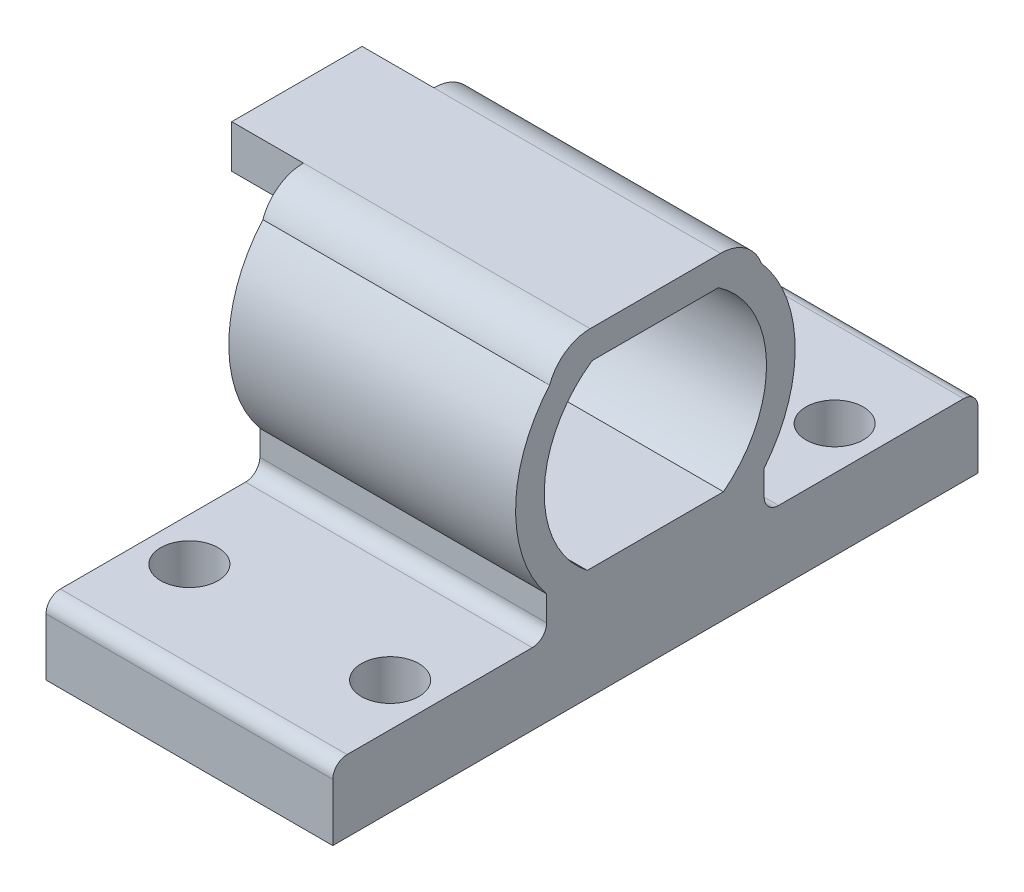
ISO-10303-21;
HEADER;
FILE_DESCRIPTION(('STEP AP214'),'2;1');
FILE_NAME('part.step','',(''),(''),'','','');
FILE_SCHEMA(('AUTOMOTIVE_DESIGN { 1 0 10303 214 1 1 1 1 }'));
ENDSEC;
DATA;
#1=APPLICATION_CONTEXT('core data for automotive mechanical design processes');
#2=APPLICATION_PROTOCOL_DEFINITION('international standard','automotive_design',2000,#1);
#3=PRODUCT_CONTEXT('',#1,'mechanical');
#4=PRODUCT('Part','Part','',(#3));
#5=PRODUCT_RELATED_PRODUCT_CATEGORY('part','',(#4));
#6=PRODUCT_DEFINITION_FORMATION('','',#4);
#7=PRODUCT_DEFINITION_CONTEXT('part definition',#1,'design');
#8=PRODUCT_DEFINITION('design','',#6,#7);
#9=PRODUCT_DEFINITION_SHAPE('','',#8);
#10=(LENGTH_UNIT() NAMED_UNIT(*) SI_UNIT(.MILLI.,.METRE.));
#11=(NAMED_UNIT(*) PLANE_ANGLE_UNIT() SI_UNIT($,.RADIAN.));
#12=(NAMED_UNIT(*) SI_UNIT($,.STERADIAN.) SOLID_ANGLE_UNIT());
#13=UNCERTAINTY_MEASURE_WITH_UNIT(LENGTH_MEASURE(1.E-05),#10,'distance_accuracy_value','');
#14=(GEOMETRIC_REPRESENTATION_CONTEXT(3) GLOBAL_UNCERTAINTY_ASSIGNED_CONTEXT((#13)) GLOBAL_UNIT_ASSIGNED_CONTEXT((#10,
#11,#12)) REPRESENTATION_CONTEXT('',''));
#15=CARTESIAN_POINT('',(0.,0.,0.));
#16=DIRECTION('',(0.,0.,1.));
#17=DIRECTION('',(1.,0.,0.));
#18=AXIS2_PLACEMENT_3D('',#15,#16,#17);
#19=CARTESIAN_POINT('',(-5.07534246575342,3.80650684931507,25.));
#20=DIRECTION('',(1.,0.,0.));
#21=DIRECTION('',(0.,0.,-1.));
#22=AXIS2_PLACEMENT_3D('',#19,#20,#21);
#23=PLANE('',#22);
#24=DIRECTION('',(0.,1.,0.));
#25=VECTOR('',#24,1.);
#26=CARTESIAN_POINT('',(-5.07534246575342,15.3065068493151,17.0475886645501));
#27=LINE('',#26,#25);
#28=CARTESIAN_POINT('',(-5.07534246575342,16.2057341612604,17.0475886645501));
#29=VERTEX_POINT('',#28);
#30=CARTESIAN_POINT('',(-5.07534246575342,18.3065068493151,17.0475886645501));
#31=VERTEX_POINT('',#30);
#32=EDGE_CURVE('E11',#29,#31,#27,.T.);
#33=ORIENTED_EDGE('',*,*,#32,.F.);
#34=CARTESIAN_POINT('',(-5.07534246575343,9.93023120627303,12.5));
#35=DIRECTION('',(1.,0.,0.));
#36=DIRECTION('',(0.,0.,-1.));
#37=AXIS2_PLACEMENT_3D('',#34,#35,#36);
#38=CIRCLE('',#37,7.75);
#39=CARTESIAN_POINT('',(-5.07534246575342,3.80650684931507,17.25));
#40=VERTEX_POINT('',#39);
#41=EDGE_CURVE('E312',#29,#40,#38,.T.);
#42=ORIENTED_EDGE('',*,*,#41,.T.);
#43=DIRECTION('',(0.,0.,-1.));
#44=VECTOR('',#43,1.);
#45=CARTESIAN_POINT('',(-5.07534246575342,3.80650684931507,25.));
#46=LINE('',#45,#44);
#47=CARTESIAN_POINT('',(-5.07534246575343,3.80650684931508,7.75));
#48=VERTEX_POINT('',#47);
#49=EDGE_CURVE('E317',#40,#48,#46,.T.);
#50=ORIENTED_EDGE('',*,*,#49,.T.);
#51=CARTESIAN_POINT('',(-5.07534246575342,16.2057341612604,7.95241133544988));
#52=VERTEX_POINT('',#51);
#53=EDGE_CURVE('E314',#48,#52,#38,.T.);
#54=ORIENTED_EDGE('',*,*,#53,.T.);
#55=DIRECTION('',(0.,1.,0.));
#56=VECTOR('',#55,1.);
#57=CARTESIAN_POINT('',(-5.07534246575342,15.3065068493151,7.95241133544988));
#58=LINE('',#57,#56);
#59=CARTESIAN_POINT('',(-5.07534246575343,18.3065068493151,7.95241133544988));
#60=VERTEX_POINT('',#59);
#61=EDGE_CURVE('E42',#52,#60,#58,.T.);
#62=ORIENTED_EDGE('',*,*,#61,.T.);
#63=CARTESIAN_POINT('',(-5.07534246575343,15.3065068493151,7.95241133544988));
#64=DIRECTION('',(1.,0.,0.));
#65=DIRECTION('',(0.,0.,-1.));
#66=AXIS2_PLACEMENT_3D('',#63,#64,#65);
#67=CIRCLE('',#66,3.);
#68=CARTESIAN_POINT('',(-5.07534246575343,16.3065068493151,5.12398421070368));
#69=VERTEX_POINT('',#68);
#70=EDGE_CURVE('E354',#60,#69,#67,.F.);
#71=ORIENTED_EDGE('',*,*,#70,.T.);
#72=CARTESIAN_POINT('',(-5.07534246575343,9.93023120627303,12.5));
#73=DIRECTION('',(1.,0.,0.));
#74=DIRECTION('',(0.,0.,-1.));
#75=AXIS2_PLACEMENT_3D('',#72,#73,#74);
#76=CIRCLE('',#75,9.75);
#77=CARTESIAN_POINT('',(-5.07534246575342,3.80650684931507,4.91300454725326));
#78=VERTEX_POINT('',#77);
#79=EDGE_CURVE('E313',#69,#78,#76,.F.);
#80=ORIENTED_EDGE('',*,*,#79,.T.);
#81=DIRECTION('',(0.,-1.,0.));
#82=VECTOR('',#81,1.);
#83=CARTESIAN_POINT('',(-5.07534246575342,3.80650684931508,4.91300454725324));
#84=LINE('',#83,#82);
#85=CARTESIAN_POINT('',(-5.07534246575342,2.05650684931507,4.91300454725324));
#86=VERTEX_POINT('',#85);
#87=EDGE_CURVE('E291',#78,#86,#84,.T.);
#88=ORIENTED_EDGE('',*,*,#87,.T.);
#89=CARTESIAN_POINT('',(-5.07534246575342,2.05650684931507,3.91300454725324));
#90=DIRECTION('',(1.,0.,0.));
#91=DIRECTION('',(0.,0.,-1.));
#92=AXIS2_PLACEMENT_3D('',#89,#90,#91);
#93=CIRCLE('',#92,1.);
#94=CARTESIAN_POINT('',(-5.07534246575342,1.05650684931507,3.91300454725324));
#95=VERTEX_POINT('',#94);
#96=EDGE_CURVE('E37',#86,#95,#93,.T.);
#97=ORIENTED_EDGE('',*,*,#96,.T.);
#98=DIRECTION('',(0.,0.,-1.));
#99=VECTOR('',#98,1.);
#100=CARTESIAN_POINT('',(-5.07534246575342,1.05650684931507,4.91300454725324));
#101=LINE('',#100,#99);
#102=CARTESIAN_POINT('',(-5.07534246575342,1.05650684931507,-9.));
#103=VERTEX_POINT('',#102);
#104=EDGE_CURVE('E293',#95,#103,#101,.T.);
#105=ORIENTED_EDGE('',*,*,#104,.T.);
#106=CARTESIAN_POINT('',(-5.07534246575342,0.056506849315069,-9.));
#107=DIRECTION('',(1.,0.,0.));
#108=DIRECTION('',(0.,0.,-1.));
#109=AXIS2_PLACEMENT_3D('',#106,#107,#108);
#110=CIRCLE('',#109,1.);
#111=CARTESIAN_POINT('',(-5.07534246575342,0.056506849315069,-10.));
#112=VERTEX_POINT('',#111);
#113=EDGE_CURVE('E380',#103,#112,#110,.F.);
#114=ORIENTED_EDGE('',*,*,#113,.T.);
#115=DIRECTION('',(0.,1.,0.));
#116=VECTOR('',#115,1.);
#117=CARTESIAN_POINT('',(-5.07534246575342,1.05650684931507,-10.));
#118=LINE('',#117,#116);
#119=CARTESIAN_POINT('',(-5.07534246575342,-3.94349315068493,-10.));
#120=VERTEX_POINT('',#119);
#121=EDGE_CURVE('E274',#120,#112,#118,.T.);
#122=ORIENTED_EDGE('',*,*,#121,.F.);
#123=DIRECTION('',(0.,0.,-1.));
#124=VECTOR('',#123,1.);
#125=CARTESIAN_POINT('',(-5.07534246575342,-3.94349315068493,-10.));
#126=LINE('',#125,#124);
#127=CARTESIAN_POINT('',(-5.07534246575342,-3.94349315068493,35.));
#128=VERTEX_POINT('',#127);
#129=EDGE_CURVE('E219',#128,#120,#126,.T.);
#130=ORIENTED_EDGE('',*,*,#129,.F.);
#131=DIRECTION('',(0.,-1.,0.));
#132=VECTOR('',#131,1.);
#133=CARTESIAN_POINT('',(-5.07534246575342,1.05650684931507,35.));
#134=LINE('',#133,#132);
#135=CARTESIAN_POINT('',(-5.07534246575342,0.0565068493150677,35.));
#136=VERTEX_POINT('',#135);
#137=EDGE_CURVE('E210',#136,#128,#134,.T.);
#138=ORIENTED_EDGE('',*,*,#137,.F.);
#139=CARTESIAN_POINT('',(-5.07534246575342,0.0565068493150678,34.));
#140=DIRECTION('',(1.,0.,0.));
#141=DIRECTION('',(0.,0.,-1.));
#142=AXIS2_PLACEMENT_3D('',#139,#140,#141);
#143=CIRCLE('',#142,1.);
#144=CARTESIAN_POINT('',(-5.07534246575342,1.05650684931507,34.));
#145=VERTEX_POINT('',#144);
#146=EDGE_CURVE('E366',#136,#145,#143,.F.);
#147=ORIENTED_EDGE('',*,*,#146,.T.);
#148=DIRECTION('',(0.,0.,-1.));
#149=VECTOR('',#148,1.);
#150=CARTESIAN_POINT('',(-5.07534246575342,1.05650684931507,20.0869954527468));
#151=LINE('',#150,#149);
#152=CARTESIAN_POINT('',(-5.07534246575342,1.05650684931507,21.0869954527468));
#153=VERTEX_POINT('',#152);
#154=EDGE_CURVE('E301',#145,#153,#151,.T.);
#155=ORIENTED_EDGE('',*,*,#154,.T.);
#156=CARTESIAN_POINT('',(-5.07534246575342,2.05650684931507,21.0869954527468));
#157=DIRECTION('',(1.,0.,0.));
#158=DIRECTION('',(0.,0.,-1.));
#159=AXIS2_PLACEMENT_3D('',#156,#157,#158);
#160=CIRCLE('',#159,1.);
#161=CARTESIAN_POINT('',(-5.07534246575342,2.05650684931507,20.0869954527468));
#162=VERTEX_POINT('',#161);
#163=EDGE_CURVE('E389',#153,#162,#160,.T.);
#164=ORIENTED_EDGE('',*,*,#163,.T.);
#165=DIRECTION('',(0.,1.,0.));
#166=VECTOR('',#165,1.);
#167=CARTESIAN_POINT('',(-5.07534246575342,3.80650684931509,20.0869954527468));
#168=LINE('',#167,#166);
#169=CARTESIAN_POINT('',(-5.07534246575342,3.80650684931509,20.0869954527468));
#170=VERTEX_POINT('',#169);
#171=EDGE_CURVE('E299',#162,#170,#168,.T.);
#172=ORIENTED_EDGE('',*,*,#171,.T.);
#173=CARTESIAN_POINT('',(-5.07534246575342,16.3065068493151,19.8760157892963));
#174=VERTEX_POINT('',#173);
#175=EDGE_CURVE('E309',#170,#174,#76,.F.);
#176=ORIENTED_EDGE('',*,*,#175,.T.);
#177=CARTESIAN_POINT('',(-5.07534246575343,15.3065068493151,17.0475886645501));
#178=DIRECTION('',(1.,0.,0.));
#179=DIRECTION('',(0.,0.,-1.));
#180=AXIS2_PLACEMENT_3D('',#177,#178,#179);
#181=CIRCLE('',#180,3.);
#182=EDGE_CURVE('E361',#174,#31,#181,.F.);
#183=ORIENTED_EDGE('',*,*,#182,.T.);
#184=EDGE_LOOP('',(#33,#42,#50,#54,#62,#71,#80,#88,#97,#105,#114,#122,#130,#138,#147,#155,#164,
#172,#176,#183));
#185=FACE_BOUND('',#184,.T.);
#186=ADVANCED_FACE('F33',(#185),#23,.F.);
#187=CARTESIAN_POINT('',(-30.2194297421029,9.93023120627303,12.5));
#188=DIRECTION('',(1.,0.,0.));
#189=DIRECTION('',(0.,0.,-1.));
#190=AXIS2_PLACEMENT_3D('',#187,#188,#189);
#191=CYLINDRICAL_SURFACE('',#190,7.75);
#192=DIRECTION('',(1.,0.,0.));
#193=VECTOR('',#192,1.);
#194=CARTESIAN_POINT('',(-30.2194297421029,16.3065068493151,8.09482021661447));
#195=LINE('',#194,#193);
#196=CARTESIAN_POINT('',(-5.07534246575342,16.3065068493151,8.09482021661447));
#197=VERTEX_POINT('',#196);
#198=CARTESIAN_POINT('',(14.9246575342466,16.3065068493151,8.09482021661447));
#199=VERTEX_POINT('',#198);
#200=EDGE_CURVE('E288',#197,#199,#195,.T.);
#201=ORIENTED_EDGE('',*,*,#200,.F.);
#202=EDGE_CURVE('E318',#52,#197,#38,.T.);
#203=ORIENTED_EDGE('',*,*,#202,.F.);
#204=ORIENTED_EDGE('',*,*,#53,.F.);
#205=DIRECTION('',(1.,0.,0.));
#206=VECTOR('',#205,1.);
#207=CARTESIAN_POINT('',(-30.2194297421029,3.80650684931508,7.75));
#208=LINE('',#207,#206);
#209=CARTESIAN_POINT('',(14.9246575342466,3.80650684931508,7.75));
#210=VERTEX_POINT('',#209);
#211=EDGE_CURVE('E327',#48,#210,#208,.T.);
#212=ORIENTED_EDGE('',*,*,#211,.T.);
#213=CARTESIAN_POINT('',(14.9246575342466,9.93023120627303,12.5));
#214=DIRECTION('',(-1.,0.,0.));
#215=DIRECTION('',(0.,0.,-1.));
#216=AXIS2_PLACEMENT_3D('',#213,#214,#215);
#217=CIRCLE('',#216,7.75);
#218=EDGE_CURVE('E305',#199,#210,#217,.T.);
#219=ORIENTED_EDGE('',*,*,#218,.F.);
#220=EDGE_LOOP('',(#201,#203,#204,#212,#219));
#221=FACE_BOUND('',#220,.T.);
#222=ADVANCED_FACE('F441',(#221),#191,.F.);
#223=CARTESIAN_POINT('',(-30.2194297421029,9.93023120627303,12.5));
#224=DIRECTION('',(1.,0.,0.));
#225=DIRECTION('',(0.,0.,-1.));
#226=AXIS2_PLACEMENT_3D('',#223,#224,#225);
#227=CYLINDRICAL_SURFACE('',#226,9.75);
#228=DIRECTION('',(1.,0.,0.));
#229=VECTOR('',#228,1.);
#230=CARTESIAN_POINT('',(-30.2194297421029,16.3065068493151,5.12398421070368));
#231=LINE('',#230,#229);
#232=CARTESIAN_POINT('',(14.9246575342466,16.3065068493151,5.12398421070368));
#233=VERTEX_POINT('',#232);
#234=EDGE_CURVE('E346',#233,#69,#231,.F.);
#235=ORIENTED_EDGE('',*,*,#234,.F.);
#236=CARTESIAN_POINT('',(14.9246575342466,9.93023120627303,12.5));
#237=DIRECTION('',(1.,0.,0.));
#238=DIRECTION('',(0.,0.,-1.));
#239=AXIS2_PLACEMENT_3D('',#236,#237,#238);
#240=CIRCLE('',#239,9.75);
#241=CARTESIAN_POINT('',(14.9246575342466,3.80650684931508,4.91300454725324));
#242=VERTEX_POINT('',#241);
#243=EDGE_CURVE('E324',#242,#233,#240,.T.);
#244=ORIENTED_EDGE('',*,*,#243,.F.);
#245=DIRECTION('',(1.,0.,0.));
#246=VECTOR('',#245,1.);
#247=CARTESIAN_POINT('',(-30.2194297421029,3.80650684931508,4.91300454725324));
#248=LINE('',#247,#246);
#249=EDGE_CURVE('E334',#78,#242,#248,.T.);
#250=ORIENTED_EDGE('',*,*,#249,.F.);
#251=ORIENTED_EDGE('',*,*,#79,.F.);
#252=EDGE_LOOP('',(#235,#244,#250,#251));
#253=FACE_BOUND('',#252,.T.);
#254=ADVANCED_FACE('F414',(#253),#227,.T.);
#255=CARTESIAN_POINT('',(-5.07534246575342,3.80650684931507,25.));
#256=DIRECTION('',(0.,-1.,0.));
#257=DIRECTION('',(0.,0.,-1.));
#258=AXIS2_PLACEMENT_3D('',#255,#256,#257);
#259=PLANE('',#258);
#260=DIRECTION('',(0.,0.,-1.));
#261=VECTOR('',#260,1.);
#262=CARTESIAN_POINT('',(14.9246575342466,3.80650684931507,25.));
#263=LINE('',#262,#261);
#264=CARTESIAN_POINT('',(14.9246575342466,3.80650684931508,17.25));
#265=VERTEX_POINT('',#264);
#266=EDGE_CURVE('E340',#265,#210,#263,.T.);
#267=ORIENTED_EDGE('',*,*,#266,.T.);
#268=ORIENTED_EDGE('',*,*,#211,.F.);
#269=ORIENTED_EDGE('',*,*,#49,.F.);
#270=DIRECTION('',(1.,0.,0.));
#271=VECTOR('',#270,1.);
#272=CARTESIAN_POINT('',(-30.2194297421029,3.80650684931508,17.25));
#273=LINE('',#272,#271);
#274=EDGE_CURVE('E328',#40,#265,#273,.T.);
#275=ORIENTED_EDGE('',*,*,#274,.T.);
#276=EDGE_LOOP('',(#267,#268,#269,#275));
#277=FACE_BOUND('',#276,.T.);
#278=ADVANCED_FACE('F508',(#277),#259,.F.);
#279=CARTESIAN_POINT('',(14.9246575342466,3.80650684931507,25.));
#280=DIRECTION('',(-1.,0.,0.));
#281=DIRECTION('',(0.,-1.,0.));
#282=AXIS2_PLACEMENT_3D('',#279,#280,#281);
#283=PLANE('',#282);
#284=CARTESIAN_POINT('',(14.9246575342466,16.3065068493151,16.9051797833855));
#285=VERTEX_POINT('',#284);
#286=EDGE_CURVE('E320',#265,#285,#217,.T.);
#287=ORIENTED_EDGE('',*,*,#286,.T.);
#288=DIRECTION('',(0.,0.,-1.));
#289=VECTOR('',#288,1.);
#290=CARTESIAN_POINT('',(14.9246575342466,16.3065068493151,19.8760157892963));
#291=LINE('',#290,#289);
#292=EDGE_CURVE('E277',#285,#199,#291,.T.);
#293=ORIENTED_EDGE('',*,*,#292,.T.);
#294=ORIENTED_EDGE('',*,*,#218,.T.);
#295=ORIENTED_EDGE('',*,*,#266,.F.);
#296=EDGE_LOOP('',(#287,#293,#294,#295));
#297=FACE_BOUND('',#296,.T.);
#298=DIRECTION('',(0.,-1.,0.));
#299=VECTOR('',#298,1.);
#300=CARTESIAN_POINT('',(14.9246575342466,1.05650684931507,-10.));
#301=LINE('',#300,#299);
#302=CARTESIAN_POINT('',(14.9246575342466,0.056506849315069,-10.));
#303=VERTEX_POINT('',#302);
#304=CARTESIAN_POINT('',(14.9246575342466,-3.94349315068493,-10.));
#305=VERTEX_POINT('',#304);
#306=EDGE_CURVE('E209',#303,#305,#301,.T.);
#307=ORIENTED_EDGE('',*,*,#306,.F.);
#308=CARTESIAN_POINT('',(14.9246575342466,0.056506849315069,-9.));
#309=DIRECTION('',(-1.,0.,0.));
#310=DIRECTION('',(0.,-1.,0.));
#311=AXIS2_PLACEMENT_3D('',#308,#309,#310);
#312=CIRCLE('',#311,1.);
#313=CARTESIAN_POINT('',(14.9246575342466,1.05650684931507,-9.));
#314=VERTEX_POINT('',#313);
#315=EDGE_CURVE('E374',#303,#314,#312,.F.);
#316=ORIENTED_EDGE('',*,*,#315,.T.);
#317=DIRECTION('',(0.,0.,-1.));
#318=VECTOR('',#317,1.);
#319=CARTESIAN_POINT('',(14.9246575342466,1.05650684931507,4.91300454725324));
#320=LINE('',#319,#318);
#321=CARTESIAN_POINT('',(14.9246575342466,1.05650684931507,3.91300454725324));
#322=VERTEX_POINT('',#321);
#323=EDGE_CURVE('E294',#322,#314,#320,.T.);
#324=ORIENTED_EDGE('',*,*,#323,.F.);
#325=CARTESIAN_POINT('',(14.9246575342466,2.05650684931507,3.91300454725324));
#326=DIRECTION('',(-1.,0.,0.));
#327=DIRECTION('',(0.,-1.,0.));
#328=AXIS2_PLACEMENT_3D('',#325,#326,#327);
#329=CIRCLE('',#328,1.);
#330=CARTESIAN_POINT('',(14.9246575342466,2.05650684931507,4.91300454725324));
#331=VERTEX_POINT('',#330);
#332=EDGE_CURVE('E59',#322,#331,#329,.T.);
#333=ORIENTED_EDGE('',*,*,#332,.T.);
#334=DIRECTION('',(0.,-1.,0.));
#335=VECTOR('',#334,1.);
#336=CARTESIAN_POINT('',(14.9246575342466,3.80650684931508,4.91300454725324));
#337=LINE('',#336,#335);
#338=EDGE_CURVE('E290',#242,#331,#337,.T.);
#339=ORIENTED_EDGE('',*,*,#338,.F.);
#340=ORIENTED_EDGE('',*,*,#243,.T.);
#341=CARTESIAN_POINT('',(14.9246575342466,15.3065068493151,7.95241133544988));
#342=DIRECTION('',(-1.,0.,0.));
#343=DIRECTION('',(0.,-1.,0.));
#344=AXIS2_PLACEMENT_3D('',#341,#342,#343);
#345=CIRCLE('',#344,3.);
#346=CARTESIAN_POINT('',(14.9246575342466,18.3065068493151,7.95241133544988));
#347=VERTEX_POINT('',#346);
#348=EDGE_CURVE('E349',#233,#347,#345,.F.);
#349=ORIENTED_EDGE('',*,*,#348,.T.);
#350=DIRECTION('',(0.,0.,1.));
#351=VECTOR('',#350,1.);
#352=CARTESIAN_POINT('',(14.9246575342466,18.3065068493151,5.12398421070368));
#353=LINE('',#352,#351);
#354=CARTESIAN_POINT('',(14.9246575342466,18.3065068493151,17.0475886645501));
#355=VERTEX_POINT('',#354);
#356=EDGE_CURVE('E280',#347,#355,#353,.T.);
#357=ORIENTED_EDGE('',*,*,#356,.T.);
#358=CARTESIAN_POINT('',(14.9246575342466,15.3065068493151,17.0475886645501));
#359=DIRECTION('',(-1.,0.,0.));
#360=DIRECTION('',(0.,-1.,0.));
#361=AXIS2_PLACEMENT_3D('',#358,#359,#360);
#362=CIRCLE('',#361,3.);
#363=CARTESIAN_POINT('',(14.9246575342466,16.3065068493151,19.8760157892963));
#364=VERTEX_POINT('',#363);
#365=EDGE_CURVE('E359',#355,#364,#362,.F.);
#366=ORIENTED_EDGE('',*,*,#365,.T.);
#367=CARTESIAN_POINT('',(14.9246575342466,3.80650684931509,20.0869954527468));
#368=VERTEX_POINT('',#367);
#369=EDGE_CURVE('E323',#364,#368,#240,.T.);
#370=ORIENTED_EDGE('',*,*,#369,.T.);
#371=DIRECTION('',(0.,1.,0.));
#372=VECTOR('',#371,1.);
#373=CARTESIAN_POINT('',(14.9246575342466,3.80650684931509,20.0869954527468));
#374=LINE('',#373,#372);
#375=CARTESIAN_POINT('',(14.9246575342466,2.05650684931507,20.0869954527468));
#376=VERTEX_POINT('',#375);
#377=EDGE_CURVE('E296',#376,#368,#374,.T.);
#378=ORIENTED_EDGE('',*,*,#377,.F.);
#379=CARTESIAN_POINT('',(14.9246575342466,2.05650684931507,21.0869954527468));
#380=DIRECTION('',(-1.,0.,0.));
#381=DIRECTION('',(0.,-1.,0.));
#382=AXIS2_PLACEMENT_3D('',#379,#380,#381);
#383=CIRCLE('',#382,1.);
#384=CARTESIAN_POINT('',(14.9246575342466,1.05650684931507,21.0869954527468));
#385=VERTEX_POINT('',#384);
#386=EDGE_CURVE('E387',#376,#385,#383,.T.);
#387=ORIENTED_EDGE('',*,*,#386,.T.);
#388=DIRECTION('',(0.,0.,-1.));
#389=VECTOR('',#388,1.);
#390=CARTESIAN_POINT('',(14.9246575342466,1.05650684931507,20.0869954527468));
#391=LINE('',#390,#389);
#392=CARTESIAN_POINT('',(14.9246575342466,1.05650684931507,34.));
#393=VERTEX_POINT('',#392);
#394=EDGE_CURVE('E302',#393,#385,#391,.T.);
#395=ORIENTED_EDGE('',*,*,#394,.F.);
#396=CARTESIAN_POINT('',(14.9246575342466,0.0565068493150678,34.));
#397=DIRECTION('',(-1.,0.,0.));
#398=DIRECTION('',(0.,-1.,0.));
#399=AXIS2_PLACEMENT_3D('',#396,#397,#398);
#400=CIRCLE('',#399,1.);
#401=CARTESIAN_POINT('',(14.9246575342466,0.0565068493150677,35.));
#402=VERTEX_POINT('',#401);
#403=EDGE_CURVE('E205',#393,#402,#400,.F.);
#404=ORIENTED_EDGE('',*,*,#403,.T.);
#405=DIRECTION('',(0.,1.,0.));
#406=VECTOR('',#405,1.);
#407=CARTESIAN_POINT('',(14.9246575342466,1.05650684931507,35.));
#408=LINE('',#407,#406);
#409=CARTESIAN_POINT('',(14.9246575342466,-3.94349315068493,35.));
#410=VERTEX_POINT('',#409);
#411=EDGE_CURVE('E197',#410,#402,#408,.T.);
#412=ORIENTED_EDGE('',*,*,#411,.F.);
#413=DIRECTION('',(0.,0.,1.));
#414=VECTOR('',#413,1.);
#415=CARTESIAN_POINT('',(14.9246575342466,-3.94349315068493,-10.));
#416=LINE('',#415,#414);
#417=EDGE_CURVE('E202',#305,#410,#416,.T.);
#418=ORIENTED_EDGE('',*,*,#417,.F.);
#419=EDGE_LOOP('',(#307,#316,#324,#333,#339,#340,#349,#357,#366,#370,#378,#387,#395,#404,#412,#418));
#420=FACE_BOUND('',#419,.T.);
#421=ADVANCED_FACE('F200',(#297,#420),#283,.F.);
#422=DIRECTION('',(1.,0.,0.));
#423=VECTOR('',#422,1.);
#424=CARTESIAN_POINT('',(-30.2194297421029,16.3065068493151,16.9051797833855));
#425=LINE('',#424,#423);
#426=CARTESIAN_POINT('',(-5.07534246575343,16.3065068493151,16.9051797833855));
#427=VERTEX_POINT('',#426);
#428=EDGE_CURVE('E285',#285,#427,#425,.F.);
#429=ORIENTED_EDGE('',*,*,#428,.F.);
#430=ORIENTED_EDGE('',*,*,#286,.F.);
#431=ORIENTED_EDGE('',*,*,#274,.F.);
#432=ORIENTED_EDGE('',*,*,#41,.F.);
#433=EDGE_CURVE('E319',#427,#29,#38,.T.);
#434=ORIENTED_EDGE('',*,*,#433,.F.);
#435=EDGE_LOOP('',(#429,#430,#431,#432,#434));
#436=FACE_BOUND('',#435,.T.);
#437=ADVANCED_FACE('F448',(#436),#191,.F.);
#438=DIRECTION('',(1.,0.,0.));
#439=VECTOR('',#438,1.);
#440=CARTESIAN_POINT('',(-30.2194297421029,16.3065068493151,19.8760157892963));
#441=LINE('',#440,#439);
#442=EDGE_CURVE('E343',#174,#364,#441,.T.);
#443=ORIENTED_EDGE('',*,*,#442,.F.);
#444=ORIENTED_EDGE('',*,*,#175,.F.);
#445=DIRECTION('',(1.,0.,0.));
#446=VECTOR('',#445,1.);
#447=CARTESIAN_POINT('',(-30.2194297421029,3.80650684931509,20.0869954527468));
#448=LINE('',#447,#446);
#449=EDGE_CURVE('E331',#170,#368,#448,.T.);
#450=ORIENTED_EDGE('',*,*,#449,.T.);
#451=ORIENTED_EDGE('',*,*,#369,.F.);
#452=EDGE_LOOP('',(#443,#444,#450,#451));
#453=FACE_BOUND('',#452,.T.);
#454=ADVANCED_FACE('F485',(#453),#227,.T.);
#455=CARTESIAN_POINT('',(-5.07534246575342,3.80650684931509,20.0869954527468));
#456=DIRECTION('',(0.,0.,-1.));
#457=DIRECTION('',(-1.,0.,0.));
#458=AXIS2_PLACEMENT_3D('',#455,#456,#457);
#459=PLANE('',#458);
#460=ORIENTED_EDGE('',*,*,#171,.F.);
#461=DIRECTION('',(1.,0.,0.));
#462=VECTOR('',#461,1.);
#463=CARTESIAN_POINT('',(14.9246575342466,2.05650684931507,20.0869954527468));
#464=LINE('',#463,#462);
#465=EDGE_CURVE('E382',#162,#376,#464,.T.);
#466=ORIENTED_EDGE('',*,*,#465,.T.);
#467=ORIENTED_EDGE('',*,*,#377,.T.);
#468=ORIENTED_EDGE('',*,*,#449,.F.);
#469=EDGE_LOOP('',(#460,#466,#467,#468));
#470=FACE_BOUND('',#469,.T.);
#471=ADVANCED_FACE('F479',(#470),#459,.F.);
#472=CARTESIAN_POINT('',(-5.07534246575342,1.05650684931507,20.0869954527468));
#473=DIRECTION('',(0.,-1.,0.));
#474=DIRECTION('',(0.,0.,-1.));
#475=AXIS2_PLACEMENT_3D('',#472,#473,#474);
#476=PLANE('',#475);
#477=CARTESIAN_POINT('',(11.9246575342466,1.05650684931507,28.));
#478=DIRECTION('',(0.,1.,0.));
#479=DIRECTION('',(0.,0.,1.));
#480=AXIS2_PLACEMENT_3D('',#477,#478,#479);
#481=CIRCLE('',#480,2.);
#482=CARTESIAN_POINT('',(11.9246575342466,1.05650684931507,30.));
#483=VERTEX_POINT('',#482);
#484=EDGE_CURVE('E266',#483,#483,#481,.T.);
#485=ORIENTED_EDGE('',*,*,#484,.F.);
#486=EDGE_LOOP('',(#485));
#487=FACE_BOUND('',#486,.T.);
#488=CARTESIAN_POINT('',(-2.07534246575342,1.05650684931507,28.));
#489=DIRECTION('',(0.,1.,0.));
#490=DIRECTION('',(0.,0.,1.));
#491=AXIS2_PLACEMENT_3D('',#488,#489,#490);
#492=CIRCLE('',#491,2.);
#493=CARTESIAN_POINT('',(-2.07534246575342,1.05650684931507,30.));
#494=VERTEX_POINT('',#493);
#495=EDGE_CURVE('E269',#494,#494,#492,.T.);
#496=ORIENTED_EDGE('',*,*,#495,.F.);
#497=EDGE_LOOP('',(#496));
#498=FACE_BOUND('',#497,.T.);
#499=ORIENTED_EDGE('',*,*,#394,.T.);
#500=DIRECTION('',(1.,0.,0.));
#501=VECTOR('',#500,1.);
#502=CARTESIAN_POINT('',(-5.07534246575342,1.05650684931507,21.0869954527468));
#503=LINE('',#502,#501);
#504=EDGE_CURVE('E385',#385,#153,#503,.F.);
#505=ORIENTED_EDGE('',*,*,#504,.T.);
#506=ORIENTED_EDGE('',*,*,#154,.F.);
#507=DIRECTION('',(-1.,0.,0.));
#508=VECTOR('',#507,1.);
#509=CARTESIAN_POINT('',(14.9246575342466,1.05650684931507,34.));
#510=LINE('',#509,#508);
#511=EDGE_CURVE('E368',#145,#393,#510,.F.);
#512=ORIENTED_EDGE('',*,*,#511,.T.);
#513=EDGE_LOOP('',(#499,#505,#506,#512));
#514=FACE_BOUND('',#513,.T.);
#515=ADVANCED_FACE('F490',(#487,#498,#514),#476,.F.);
#516=CARTESIAN_POINT('',(-5.07534246575342,3.80650684931508,4.91300454725324));
#517=DIRECTION('',(0.,0.,1.));
#518=DIRECTION('',(1.,0.,0.));
#519=AXIS2_PLACEMENT_3D('',#516,#517,#518);
#520=PLANE('',#519);
#521=ORIENTED_EDGE('',*,*,#338,.T.);
#522=DIRECTION('',(1.,0.,0.));
#523=VECTOR('',#522,1.);
#524=CARTESIAN_POINT('',(-5.07534246575342,2.05650684931507,4.91300454725324));
#525=LINE('',#524,#523);
#526=EDGE_CURVE('E51',#331,#86,#525,.F.);
#527=ORIENTED_EDGE('',*,*,#526,.T.);
#528=ORIENTED_EDGE('',*,*,#87,.F.);
#529=ORIENTED_EDGE('',*,*,#249,.T.);
#530=EDGE_LOOP('',(#521,#527,#528,#529));
#531=FACE_BOUND('',#530,.T.);
#532=ADVANCED_FACE('F416',(#531),#520,.F.);
#533=CARTESIAN_POINT('',(-5.07534246575342,1.05650684931507,4.91300454725324));
#534=DIRECTION('',(0.,-1.,0.));
#535=DIRECTION('',(0.,0.,-1.));
#536=AXIS2_PLACEMENT_3D('',#533,#534,#535);
#537=PLANE('',#536);
#538=CARTESIAN_POINT('',(-2.07534246575354,1.05650684931507,-3.));
#539=DIRECTION('',(0.,1.,0.));
#540=DIRECTION('',(0.,0.,1.));
#541=AXIS2_PLACEMENT_3D('',#538,#539,#540);
#542=CIRCLE('',#541,2.);
#543=CARTESIAN_POINT('',(-2.07534246575354,1.05650684931507,-1.));
#544=VERTEX_POINT('',#543);
#545=EDGE_CURVE('E260',#544,#544,#542,.T.);
#546=ORIENTED_EDGE('',*,*,#545,.F.);
#547=EDGE_LOOP('',(#546));
#548=FACE_BOUND('',#547,.T.);
#549=CARTESIAN_POINT('',(11.9246575342465,1.05650684931507,-3.));
#550=DIRECTION('',(0.,1.,0.));
#551=DIRECTION('',(0.,0.,1.));
#552=AXIS2_PLACEMENT_3D('',#549,#550,#551);
#553=CIRCLE('',#552,2.);
#554=CARTESIAN_POINT('',(11.9246575342465,1.05650684931507,-1.));
#555=VERTEX_POINT('',#554);
#556=EDGE_CURVE('E263',#555,#555,#553,.T.);
#557=ORIENTED_EDGE('',*,*,#556,.F.);
#558=EDGE_LOOP('',(#557));
#559=FACE_BOUND('',#558,.T.);
#560=ORIENTED_EDGE('',*,*,#104,.F.);
#561=DIRECTION('',(1.,0.,0.));
#562=VECTOR('',#561,1.);
#563=CARTESIAN_POINT('',(14.9246575342466,1.05650684931507,3.91300454725324));
#564=LINE('',#563,#562);
#565=EDGE_CURVE('E391',#95,#322,#564,.T.);
#566=ORIENTED_EDGE('',*,*,#565,.T.);
#567=ORIENTED_EDGE('',*,*,#323,.T.);
#568=DIRECTION('',(1.,0.,0.));
#569=VECTOR('',#568,1.);
#570=CARTESIAN_POINT('',(-5.07534246575342,1.05650684931507,-9.));
#571=LINE('',#570,#569);
#572=EDGE_CURVE('E377',#314,#103,#571,.F.);
#573=ORIENTED_EDGE('',*,*,#572,.T.);
#574=EDGE_LOOP('',(#560,#566,#567,#573));
#575=FACE_BOUND('',#574,.T.);
#576=ADVANCED_FACE('F420',(#548,#559,#575),#537,.F.);
#577=CARTESIAN_POINT('',(-19.9623312712773,18.3065068493151,5.12398421070368));
#578=DIRECTION('',(0.,1.,0.));
#579=DIRECTION('',(0.,0.,1.));
#580=AXIS2_PLACEMENT_3D('',#577,#578,#579);
#581=PLANE('',#580);
#582=DIRECTION('',(1.,0.,0.));
#583=VECTOR('',#582,1.);
#584=CARTESIAN_POINT('',(-10.0753424657534,18.3065068493151,7.95241133544988));
#585=LINE('',#584,#583);
#586=CARTESIAN_POINT('',(-10.0753424657534,18.3065068493151,7.95241133544988));
#587=VERTEX_POINT('',#586);
#588=EDGE_CURVE('E248',#587,#60,#585,.T.);
#589=ORIENTED_EDGE('',*,*,#588,.F.);
#590=DIRECTION('',(0.,0.,-1.));
#591=VECTOR('',#590,1.);
#592=CARTESIAN_POINT('',(-10.0753424657534,18.3065068493151,7.95241133544988));
#593=LINE('',#592,#591);
#594=CARTESIAN_POINT('',(-10.0753424657534,18.3065068493151,17.0475886645501));
#595=VERTEX_POINT('',#594);
#596=EDGE_CURVE('E235',#595,#587,#593,.T.);
#597=ORIENTED_EDGE('',*,*,#596,.F.);
#598=DIRECTION('',(-1.,0.,0.));
#599=VECTOR('',#598,1.);
#600=CARTESIAN_POINT('',(-10.0753424657534,18.3065068493151,17.0475886645501));
#601=LINE('',#600,#599);
#602=EDGE_CURVE('E240',#31,#595,#601,.T.);
#603=ORIENTED_EDGE('',*,*,#602,.F.);
#604=DIRECTION('',(-1.,0.,0.));
#605=VECTOR('',#604,1.);
#606=CARTESIAN_POINT('',(14.9246575342466,18.3065068493151,17.0475886645501));
#607=LINE('',#606,#605);
#608=EDGE_CURVE('E356',#31,#355,#607,.F.);
#609=ORIENTED_EDGE('',*,*,#608,.T.);
#610=ORIENTED_EDGE('',*,*,#356,.F.);
#611=DIRECTION('',(-1.,0.,0.));
#612=VECTOR('',#611,1.);
#613=CARTESIAN_POINT('',(-5.07534246575343,18.3065068493151,7.95241133544988));
#614=LINE('',#613,#612);
#615=EDGE_CURVE('E351',#347,#60,#614,.T.);
#616=ORIENTED_EDGE('',*,*,#615,.T.);
#617=EDGE_LOOP('',(#589,#597,#603,#609,#610,#616));
#618=FACE_BOUND('',#617,.T.);
#619=ADVANCED_FACE('F407',(#618),#581,.T.);
#620=CARTESIAN_POINT('',(-19.9623312712773,16.3065068493151,19.8760157892963));
#621=DIRECTION('',(0.,-1.,0.));
#622=DIRECTION('',(0.,0.,-1.));
#623=AXIS2_PLACEMENT_3D('',#620,#621,#622);
#624=PLANE('',#623);
#625=DIRECTION('',(0.,0.,1.));
#626=VECTOR('',#625,1.);
#627=CARTESIAN_POINT('',(-5.07534246575342,16.3065068493151,19.8760157892963));
#628=LINE('',#627,#626);
#629=EDGE_CURVE('E283',#197,#427,#628,.T.);
#630=ORIENTED_EDGE('',*,*,#629,.F.);
#631=ORIENTED_EDGE('',*,*,#200,.T.);
#632=ORIENTED_EDGE('',*,*,#292,.F.);
#633=ORIENTED_EDGE('',*,*,#428,.T.);
#634=EDGE_LOOP('',(#630,#631,#632,#633));
#635=FACE_BOUND('',#634,.T.);
#636=ADVANCED_FACE('F453',(#635),#624,.T.);
#637=CARTESIAN_POINT('',(-30.2194297421029,15.3065068493151,7.95241133544988));
#638=DIRECTION('',(1.,0.,0.));
#639=DIRECTION('',(0.,0.,-1.));
#640=AXIS2_PLACEMENT_3D('',#637,#638,#639);
#641=CYLINDRICAL_SURFACE('',#640,3.);
#642=ORIENTED_EDGE('',*,*,#70,.F.);
#643=ORIENTED_EDGE('',*,*,#615,.F.);
#644=ORIENTED_EDGE('',*,*,#348,.F.);
#645=ORIENTED_EDGE('',*,*,#234,.T.);
#646=EDGE_LOOP('',(#642,#643,#644,#645));
#647=FACE_BOUND('',#646,.T.);
#648=ADVANCED_FACE('F410',(#647),#641,.T.);
#649=CARTESIAN_POINT('',(-30.2194297421029,15.3065068493151,17.0475886645501));
#650=DIRECTION('',(1.,0.,0.));
#651=DIRECTION('',(0.,0.,-1.));
#652=AXIS2_PLACEMENT_3D('',#649,#650,#651);
#653=CYLINDRICAL_SURFACE('',#652,3.);
#654=ORIENTED_EDGE('',*,*,#182,.F.);
#655=ORIENTED_EDGE('',*,*,#442,.T.);
#656=ORIENTED_EDGE('',*,*,#365,.F.);
#657=ORIENTED_EDGE('',*,*,#608,.F.);
#658=EDGE_LOOP('',(#654,#655,#656,#657));
#659=FACE_BOUND('',#658,.T.);
#660=ADVANCED_FACE('F429',(#659),#653,.T.);
#661=CARTESIAN_POINT('',(0.,0.,-10.));
#662=DIRECTION('',(0.,0.,-1.));
#663=DIRECTION('',(-1.,0.,0.));
#664=AXIS2_PLACEMENT_3D('',#661,#662,#663);
#665=PLANE('',#664);
#666=ORIENTED_EDGE('',*,*,#121,.T.);
#667=DIRECTION('',(1.,0.,0.));
#668=VECTOR('',#667,1.);
#669=CARTESIAN_POINT('',(14.9246575342466,0.056506849315069,-10.));
#670=LINE('',#669,#668);
#671=EDGE_CURVE('E371',#112,#303,#670,.T.);
#672=ORIENTED_EDGE('',*,*,#671,.T.);
#673=ORIENTED_EDGE('',*,*,#306,.T.);
#674=DIRECTION('',(1.,0.,0.));
#675=VECTOR('',#674,1.);
#676=CARTESIAN_POINT('',(14.9246575342466,-3.94349315068493,-10.));
#677=LINE('',#676,#675);
#678=EDGE_CURVE('E225',#120,#305,#677,.T.);
#679=ORIENTED_EDGE('',*,*,#678,.F.);
#680=EDGE_LOOP('',(#666,#672,#673,#679));
#681=FACE_BOUND('',#680,.T.);
#682=ADVANCED_FACE('F427',(#681),#665,.T.);
#683=CARTESIAN_POINT('',(0.,0.,35.));
#684=DIRECTION('',(0.,0.,1.));
#685=DIRECTION('',(1.,0.,0.));
#686=AXIS2_PLACEMENT_3D('',#683,#684,#685);
#687=PLANE('',#686);
#688=ORIENTED_EDGE('',*,*,#411,.T.);
#689=DIRECTION('',(-1.,0.,0.));
#690=VECTOR('',#689,1.);
#691=CARTESIAN_POINT('',(-5.07534246575342,0.0565068493150678,35.));
#692=LINE('',#691,#690);
#693=EDGE_CURVE('E364',#402,#136,#692,.T.);
#694=ORIENTED_EDGE('',*,*,#693,.T.);
#695=ORIENTED_EDGE('',*,*,#137,.T.);
#696=DIRECTION('',(-1.,0.,0.));
#697=VECTOR('',#696,1.);
#698=CARTESIAN_POINT('',(14.9246575342466,-3.94349315068493,35.));
#699=LINE('',#698,#697);
#700=EDGE_CURVE('E213',#410,#128,#699,.T.);
#701=ORIENTED_EDGE('',*,*,#700,.F.);
#702=EDGE_LOOP('',(#688,#694,#695,#701));
#703=FACE_BOUND('',#702,.T.);
#704=ADVANCED_FACE('F214',(#703),#687,.T.);
#705=CARTESIAN_POINT('',(0.,0.0565068493150678,34.));
#706=DIRECTION('',(1.,0.,0.));
#707=DIRECTION('',(0.,0.,-1.));
#708=AXIS2_PLACEMENT_3D('',#705,#706,#707);
#709=CYLINDRICAL_SURFACE('',#708,1.);
#710=ORIENTED_EDGE('',*,*,#403,.F.);
#711=ORIENTED_EDGE('',*,*,#511,.F.);
#712=ORIENTED_EDGE('',*,*,#146,.F.);
#713=ORIENTED_EDGE('',*,*,#693,.F.);
#714=EDGE_LOOP('',(#710,#711,#712,#713));
#715=FACE_BOUND('',#714,.T.);
#716=ADVANCED_FACE('F435',(#715),#709,.T.);
#717=CARTESIAN_POINT('',(0.,0.056506849315069,-9.));
#718=DIRECTION('',(-1.,0.,0.));
#719=DIRECTION('',(0.,0.,1.));
#720=AXIS2_PLACEMENT_3D('',#717,#718,#719);
#721=CYLINDRICAL_SURFACE('',#720,1.);
#722=ORIENTED_EDGE('',*,*,#113,.F.);
#723=ORIENTED_EDGE('',*,*,#572,.F.);
#724=ORIENTED_EDGE('',*,*,#315,.F.);
#725=ORIENTED_EDGE('',*,*,#671,.F.);
#726=EDGE_LOOP('',(#722,#723,#724,#725));
#727=FACE_BOUND('',#726,.T.);
#728=ADVANCED_FACE('F425',(#727),#721,.T.);
#729=CARTESIAN_POINT('',(-2.07534246575342,-0.943493150684934,28.));
#730=DIRECTION('',(0.,1.,0.));
#731=DIRECTION('',(0.,0.,1.));
#732=AXIS2_PLACEMENT_3D('',#729,#730,#731);
#733=CYLINDRICAL_SURFACE('',#732,2.);
#734=ORIENTED_EDGE('',*,*,#495,.T.);
#735=EDGE_LOOP('',(#734));
#736=FACE_BOUND('',#735,.T.);
#737=CARTESIAN_POINT('',(-2.07534246575342,-3.94349315068493,28.));
#738=DIRECTION('',(0.,-1.,0.));
#739=DIRECTION('',(1.,0.,0.));
#740=AXIS2_PLACEMENT_3D('',#737,#738,#739);
#741=CIRCLE('',#740,2.);
#742=CARTESIAN_POINT('',(-0.0753424657534214,-3.94349315068493,28.));
#743=VERTEX_POINT('',#742);
#744=EDGE_CURVE('E566',#743,#743,#741,.T.);
#745=ORIENTED_EDGE('',*,*,#744,.T.);
#746=EDGE_LOOP('',(#745));
#747=FACE_BOUND('',#746,.T.);
#748=ADVANCED_FACE('F459',(#736,#747),#733,.F.);
#749=CARTESIAN_POINT('',(11.9246575342466,-0.943493150684934,28.));
#750=DIRECTION('',(0.,1.,0.));
#751=DIRECTION('',(0.,0.,1.));
#752=AXIS2_PLACEMENT_3D('',#749,#750,#751);
#753=CYLINDRICAL_SURFACE('',#752,2.);
#754=ORIENTED_EDGE('',*,*,#484,.T.);
#755=EDGE_LOOP('',(#754));
#756=FACE_BOUND('',#755,.T.);
#757=CARTESIAN_POINT('',(11.9246575342466,-3.94349315068493,28.));
#758=DIRECTION('',(0.,-1.,0.));
#759=DIRECTION('',(1.,0.,0.));
#760=AXIS2_PLACEMENT_3D('',#757,#758,#759);
#761=CIRCLE('',#760,2.);
#762=CARTESIAN_POINT('',(13.9246575342466,-3.94349315068493,28.));
#763=VERTEX_POINT('',#762);
#764=EDGE_CURVE('E229',#763,#763,#761,.T.);
#765=ORIENTED_EDGE('',*,*,#764,.T.);
#766=EDGE_LOOP('',(#765));
#767=FACE_BOUND('',#766,.T.);
#768=ADVANCED_FACE('F553',(#756,#767),#753,.F.);
#769=CARTESIAN_POINT('',(11.9246575342465,-0.943493150684932,-3.));
#770=DIRECTION('',(0.,1.,0.));
#771=DIRECTION('',(0.,0.,1.));
#772=AXIS2_PLACEMENT_3D('',#769,#770,#771);
#773=CYLINDRICAL_SURFACE('',#772,2.);
#774=ORIENTED_EDGE('',*,*,#556,.T.);
#775=EDGE_LOOP('',(#774));
#776=FACE_BOUND('',#775,.T.);
#777=CARTESIAN_POINT('',(11.9246575342465,-3.94349315068493,-3.));
#778=DIRECTION('',(0.,-1.,0.));
#779=DIRECTION('',(1.,0.,0.));
#780=AXIS2_PLACEMENT_3D('',#777,#778,#779);
#781=CIRCLE('',#780,2.);
#782=CARTESIAN_POINT('',(13.9246575342465,-3.94349315068493,-3.));
#783=VERTEX_POINT('',#782);
#784=EDGE_CURVE('E226',#783,#783,#781,.T.);
#785=ORIENTED_EDGE('',*,*,#784,.T.);
#786=EDGE_LOOP('',(#785));
#787=FACE_BOUND('',#786,.T.);
#788=ADVANCED_FACE('F469',(#776,#787),#773,.F.);
#789=CARTESIAN_POINT('',(-2.07534246575354,-0.943493150684932,-3.));
#790=DIRECTION('',(0.,1.,0.));
#791=DIRECTION('',(0.,0.,1.));
#792=AXIS2_PLACEMENT_3D('',#789,#790,#791);
#793=CYLINDRICAL_SURFACE('',#792,2.);
#794=ORIENTED_EDGE('',*,*,#545,.T.);
#795=EDGE_LOOP('',(#794));
#796=FACE_BOUND('',#795,.T.);
#797=CARTESIAN_POINT('',(-2.07534246575354,-3.94349315068493,-3.));
#798=DIRECTION('',(0.,-1.,0.));
#799=DIRECTION('',(1.,0.,0.));
#800=AXIS2_PLACEMENT_3D('',#797,#798,#799);
#801=CIRCLE('',#800,2.);
#802=CARTESIAN_POINT('',(-0.0753424657535351,-3.94349315068493,-3.));
#803=VERTEX_POINT('',#802);
#804=EDGE_CURVE('E568',#803,#803,#801,.T.);
#805=ORIENTED_EDGE('',*,*,#804,.T.);
#806=EDGE_LOOP('',(#805));
#807=FACE_BOUND('',#806,.T.);
#808=ADVANCED_FACE('F462',(#796,#807),#793,.F.);
#809=CARTESIAN_POINT('',(-5.07534246575342,2.05650684931507,21.0869954527468));
#810=DIRECTION('',(-1.,0.,0.));
#811=DIRECTION('',(0.,0.,1.));
#812=AXIS2_PLACEMENT_3D('',#809,#810,#811);
#813=CYLINDRICAL_SURFACE('',#812,1.);
#814=ORIENTED_EDGE('',*,*,#163,.F.);
#815=ORIENTED_EDGE('',*,*,#504,.F.);
#816=ORIENTED_EDGE('',*,*,#386,.F.);
#817=ORIENTED_EDGE('',*,*,#465,.F.);
#818=EDGE_LOOP('',(#814,#815,#816,#817));
#819=FACE_BOUND('',#818,.T.);
#820=ADVANCED_FACE('F460',(#819),#813,.F.);
#821=CARTESIAN_POINT('',(-5.07534246575342,2.05650684931507,3.91300454725324));
#822=DIRECTION('',(-1.,0.,0.));
#823=DIRECTION('',(0.,0.,1.));
#824=AXIS2_PLACEMENT_3D('',#821,#822,#823);
#825=CYLINDRICAL_SURFACE('',#824,1.);
#826=ORIENTED_EDGE('',*,*,#96,.F.);
#827=ORIENTED_EDGE('',*,*,#526,.F.);
#828=ORIENTED_EDGE('',*,*,#332,.F.);
#829=ORIENTED_EDGE('',*,*,#565,.F.);
#830=EDGE_LOOP('',(#826,#827,#828,#829));
#831=FACE_BOUND('',#830,.T.);
#832=ADVANCED_FACE('F35',(#831),#825,.F.);
#833=CARTESIAN_POINT('',(-5.07534246575342,15.3065068493151,7.95241133544988));
#834=DIRECTION('',(-1.,0.,0.));
#835=DIRECTION('',(0.,0.,1.));
#836=AXIS2_PLACEMENT_3D('',#833,#834,#835);
#837=PLANE('',#836);
#838=ORIENTED_EDGE('',*,*,#629,.T.);
#839=ORIENTED_EDGE('',*,*,#433,.T.);
#840=CARTESIAN_POINT('',(-5.07534246575342,15.3065068493151,17.0475886645501));
#841=VERTEX_POINT('',#840);
#842=EDGE_CURVE('E44',#841,#29,#27,.T.);
#843=ORIENTED_EDGE('',*,*,#842,.F.);
#844=DIRECTION('',(0.,0.,1.));
#845=VECTOR('',#844,1.);
#846=CARTESIAN_POINT('',(-5.07534246575342,15.3065068493151,7.95241133544988));
#847=LINE('',#846,#845);
#848=CARTESIAN_POINT('',(-5.07534246575342,15.3065068493151,7.95241133544988));
#849=VERTEX_POINT('',#848);
#850=EDGE_CURVE('E242',#849,#841,#847,.T.);
#851=ORIENTED_EDGE('',*,*,#850,.F.);
#852=EDGE_CURVE('E254',#849,#52,#58,.T.);
#853=ORIENTED_EDGE('',*,*,#852,.T.);
#854=ORIENTED_EDGE('',*,*,#202,.T.);
#855=EDGE_LOOP('',(#838,#839,#843,#851,#853,#854));
#856=FACE_BOUND('',#855,.T.);
#857=ADVANCED_FACE('F468',(#856),#837,.F.);
#858=CARTESIAN_POINT('',(-10.0753424657534,15.3065068493151,7.95241133544988));
#859=DIRECTION('',(1.,0.,0.));
#860=DIRECTION('',(0.,0.,-1.));
#861=AXIS2_PLACEMENT_3D('',#858,#859,#860);
#862=PLANE('',#861);
#863=ORIENTED_EDGE('',*,*,#596,.T.);
#864=DIRECTION('',(0.,1.,0.));
#865=VECTOR('',#864,1.);
#866=CARTESIAN_POINT('',(-10.0753424657534,15.3065068493151,7.95241133544988));
#867=LINE('',#866,#865);
#868=CARTESIAN_POINT('',(-10.0753424657534,15.3065068493151,7.95241133544988));
#869=VERTEX_POINT('',#868);
#870=EDGE_CURVE('E257',#869,#587,#867,.T.);
#871=ORIENTED_EDGE('',*,*,#870,.F.);
#872=DIRECTION('',(0.,0.,-1.));
#873=VECTOR('',#872,1.);
#874=CARTESIAN_POINT('',(-10.0753424657534,15.3065068493151,7.95241133544988));
#875=LINE('',#874,#873);
#876=CARTESIAN_POINT('',(-10.0753424657534,15.3065068493151,17.0475886645501));
#877=VERTEX_POINT('',#876);
#878=EDGE_CURVE('E236',#877,#869,#875,.T.);
#879=ORIENTED_EDGE('',*,*,#878,.F.);
#880=DIRECTION('',(0.,1.,0.));
#881=VECTOR('',#880,1.);
#882=CARTESIAN_POINT('',(-10.0753424657534,15.3065068493151,17.0475886645501));
#883=LINE('',#882,#881);
#884=EDGE_CURVE('E246',#877,#595,#883,.T.);
#885=ORIENTED_EDGE('',*,*,#884,.T.);
#886=EDGE_LOOP('',(#863,#871,#879,#885));
#887=FACE_BOUND('',#886,.T.);
#888=ADVANCED_FACE('F541',(#887),#862,.F.);
#889=CARTESIAN_POINT('',(-10.0753424657534,15.3065068493151,7.95241133544988));
#890=DIRECTION('',(0.,0.,1.));
#891=DIRECTION('',(0.,-1.,0.));
#892=AXIS2_PLACEMENT_3D('',#889,#890,#891);
#893=PLANE('',#892);
#894=ORIENTED_EDGE('',*,*,#588,.T.);
#895=ORIENTED_EDGE('',*,*,#61,.F.);
#896=ORIENTED_EDGE('',*,*,#852,.F.);
#897=DIRECTION('',(1.,0.,0.));
#898=VECTOR('',#897,1.);
#899=CARTESIAN_POINT('',(-10.0753424657534,15.3065068493151,7.95241133544988));
#900=LINE('',#899,#898);
#901=EDGE_CURVE('E239',#869,#849,#900,.T.);
#902=ORIENTED_EDGE('',*,*,#901,.F.);
#903=ORIENTED_EDGE('',*,*,#870,.T.);
#904=EDGE_LOOP('',(#894,#895,#896,#902,#903));
#905=FACE_BOUND('',#904,.T.);
#906=ADVANCED_FACE('F539',(#905),#893,.F.);
#907=CARTESIAN_POINT('',(-10.0753424657534,15.3065068493151,17.0475886645501));
#908=DIRECTION('',(0.,0.,-1.));
#909=DIRECTION('',(0.,1.,0.));
#910=AXIS2_PLACEMENT_3D('',#907,#908,#909);
#911=PLANE('',#910);
#912=ORIENTED_EDGE('',*,*,#602,.T.);
#913=ORIENTED_EDGE('',*,*,#884,.F.);
#914=DIRECTION('',(-1.,0.,0.));
#915=VECTOR('',#914,1.);
#916=CARTESIAN_POINT('',(-10.0753424657534,15.3065068493151,17.0475886645501));
#917=LINE('',#916,#915);
#918=EDGE_CURVE('E244',#841,#877,#917,.T.);
#919=ORIENTED_EDGE('',*,*,#918,.F.);
#920=ORIENTED_EDGE('',*,*,#842,.T.);
#921=ORIENTED_EDGE('',*,*,#32,.T.);
#922=EDGE_LOOP('',(#912,#913,#919,#920,#921));
#923=FACE_BOUND('',#922,.T.);
#924=ADVANCED_FACE('F533',(#923),#911,.F.);
#925=CARTESIAN_POINT('',(0.,15.3065068493151,0.));
#926=DIRECTION('',(0.,1.,0.));
#927=DIRECTION('',(0.,0.,1.));
#928=AXIS2_PLACEMENT_3D('',#925,#926,#927);
#929=PLANE('',#928);
#930=ORIENTED_EDGE('',*,*,#878,.T.);
#931=ORIENTED_EDGE('',*,*,#901,.T.);
#932=ORIENTED_EDGE('',*,*,#850,.T.);
#933=ORIENTED_EDGE('',*,*,#918,.T.);
#934=EDGE_LOOP('',(#930,#931,#932,#933));
#935=FACE_BOUND('',#934,.T.);
#936=ADVANCED_FACE('F537',(#935),#929,.F.);
#937=CARTESIAN_POINT('',(0.,-3.94349315068493,0.));
#938=DIRECTION('',(0.,-1.,0.));
#939=DIRECTION('',(1.,0.,0.));
#940=AXIS2_PLACEMENT_3D('',#937,#938,#939);
#941=PLANE('',#940);
#942=ORIENTED_EDGE('',*,*,#744,.F.);
#943=EDGE_LOOP('',(#942));
#944=FACE_BOUND('',#943,.T.);
#945=ORIENTED_EDGE('',*,*,#784,.F.);
#946=EDGE_LOOP('',(#945));
#947=FACE_BOUND('',#946,.T.);
#948=ORIENTED_EDGE('',*,*,#417,.T.);
#949=ORIENTED_EDGE('',*,*,#700,.T.);
#950=ORIENTED_EDGE('',*,*,#129,.T.);
#951=ORIENTED_EDGE('',*,*,#678,.T.);
#952=EDGE_LOOP('',(#948,#949,#950,#951));
#953=FACE_BOUND('',#952,.T.);
#954=ORIENTED_EDGE('',*,*,#764,.F.);
#955=EDGE_LOOP('',(#954));
#956=FACE_BOUND('',#955,.T.);
#957=ORIENTED_EDGE('',*,*,#804,.F.);
#958=EDGE_LOOP('',(#957));
#959=FACE_BOUND('',#958,.T.);
#960=ADVANCED_FACE('F222',(#944,#947,#953,#956,#959),#941,.T.);
#961=CLOSED_SHELL('',(#186,#222,#254,#278,#421,#437,#454,#471,#515,#532,#576,#619,#636,#648,
#660,#682,#704,#716,#728,#748,#768,#788,#808,#820,#832,#857,#888,#906,#924,#936,#960));
#962=MANIFOLD_SOLID_BREP('B2',#961);
#963=ADVANCED_BREP_SHAPE_REPRESENTATION('',(#18,#962),#14);
#964=SHAPE_DEFINITION_REPRESENTATION(#9,#963);
ENDSEC;
END-ISO-10303-21;
